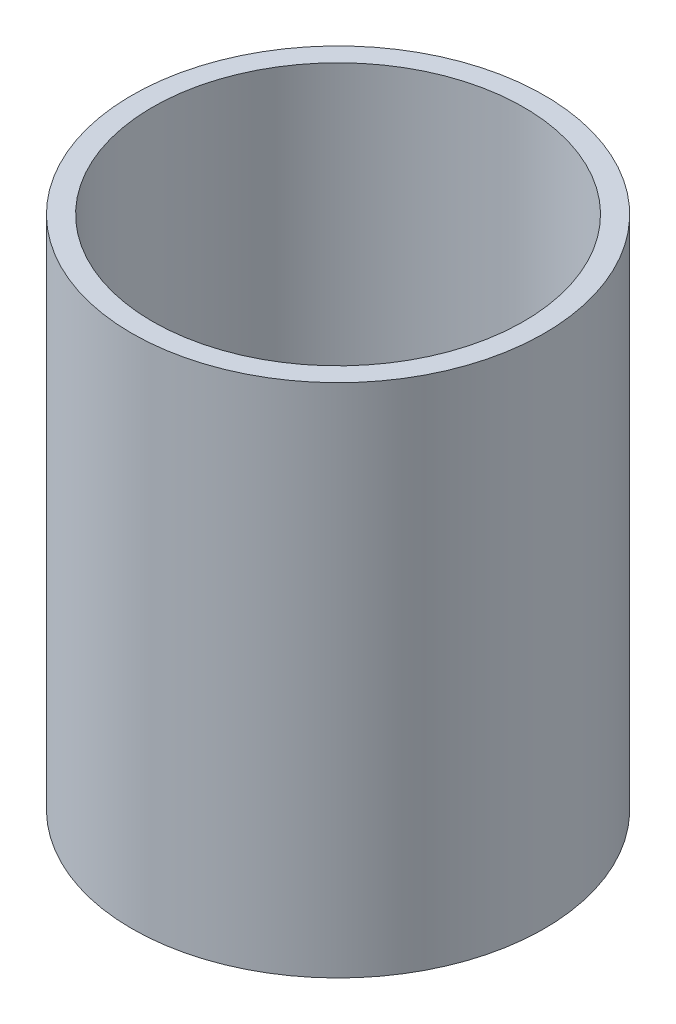
ISO-10303-21;
HEADER;
FILE_DESCRIPTION(('STEP AP214'),'2;1');
FILE_NAME('part.step','',(''),(''),'','','');
FILE_SCHEMA(('AUTOMOTIVE_DESIGN { 1 0 10303 214 1 1 1 1 }'));
ENDSEC;
DATA;
#1=APPLICATION_CONTEXT('core data for automotive mechanical design processes');
#2=APPLICATION_PROTOCOL_DEFINITION('international standard','automotive_design',2000,#1);
#3=PRODUCT_CONTEXT('',#1,'mechanical');
#4=PRODUCT('Part','Part','',(#3));
#5=PRODUCT_RELATED_PRODUCT_CATEGORY('part','',(#4));
#6=PRODUCT_DEFINITION_FORMATION('','',#4);
#7=PRODUCT_DEFINITION_CONTEXT('part definition',#1,'design');
#8=PRODUCT_DEFINITION('design','',#6,#7);
#9=PRODUCT_DEFINITION_SHAPE('','',#8);
#10=(LENGTH_UNIT() NAMED_UNIT(*) SI_UNIT(.MILLI.,.METRE.));
#11=(NAMED_UNIT(*) PLANE_ANGLE_UNIT() SI_UNIT($,.RADIAN.));
#12=(NAMED_UNIT(*) SI_UNIT($,.STERADIAN.) SOLID_ANGLE_UNIT());
#13=UNCERTAINTY_MEASURE_WITH_UNIT(LENGTH_MEASURE(1.E-05),#10,'distance_accuracy_value','');
#14=(GEOMETRIC_REPRESENTATION_CONTEXT(3) GLOBAL_UNCERTAINTY_ASSIGNED_CONTEXT((#13)) GLOBAL_UNIT_ASSIGNED_CONTEXT((#10,
#11,#12)) REPRESENTATION_CONTEXT('',''));
#15=CARTESIAN_POINT('',(0.,0.,0.));
#16=DIRECTION('',(0.,0.,1.));
#17=DIRECTION('',(1.,0.,0.));
#18=AXIS2_PLACEMENT_3D('',#15,#16,#17);
#19=CARTESIAN_POINT('',(0.,0.,0.));
#20=DIRECTION('',(0.,1.,0.));
#21=DIRECTION('',(0.,0.,1.));
#22=AXIS2_PLACEMENT_3D('',#19,#20,#21);
#23=PLANE('',#22);
#24=CARTESIAN_POINT('',(0.,0.,0.));
#25=DIRECTION('',(0.,1.,0.));
#26=DIRECTION('',(0.,0.,1.));
#27=AXIS2_PLACEMENT_3D('',#24,#25,#26);
#28=CIRCLE('',#27,20.);
#29=CARTESIAN_POINT('',(0.,0.,20.));
#30=VERTEX_POINT('',#29);
#31=EDGE_CURVE('E136',#30,#30,#28,.T.);
#32=ORIENTED_EDGE('',*,*,#31,.F.);
#33=EDGE_LOOP('',(#32));
#34=FACE_BOUND('',#33,.T.);
#35=CARTESIAN_POINT('',(0.,0.,0.));
#36=DIRECTION('',(0.,1.,0.));
#37=DIRECTION('',(0.,0.,1.));
#38=AXIS2_PLACEMENT_3D('',#35,#36,#37);
#39=CIRCLE('',#38,17.);
#40=CARTESIAN_POINT('',(1.,0.,16.9705627484771));
#41=VERTEX_POINT('',#40);
#42=CARTESIAN_POINT('',(0.999999999999994,0.,-16.9705627484771));
#43=VERTEX_POINT('',#42);
#44=EDGE_CURVE('E94',#41,#43,#39,.T.);
#45=ORIENTED_EDGE('',*,*,#44,.T.);
#46=DIRECTION('',(0.,0.,1.));
#47=VECTOR('',#46,1.);
#48=CARTESIAN_POINT('',(0.999999999999998,0.,0.));
#49=LINE('',#48,#47);
#50=EDGE_CURVE('E124',#43,#41,#49,.T.);
#51=ORIENTED_EDGE('',*,*,#50,.T.);
#52=EDGE_LOOP('',(#45,#51));
#53=FACE_BOUND('',#52,.T.);
#54=DIRECTION('',(0.,0.,1.));
#55=VECTOR('',#54,1.);
#56=CARTESIAN_POINT('',(-0.999999999999993,0.,0.));
#57=LINE('',#56,#55);
#58=CARTESIAN_POINT('',(-0.999999999999993,0.,-16.9705627484771));
#59=VERTEX_POINT('',#58);
#60=CARTESIAN_POINT('',(-0.999999999999993,0.,16.9705627484771));
#61=VERTEX_POINT('',#60);
#62=EDGE_CURVE('E11',#59,#61,#57,.T.);
#63=ORIENTED_EDGE('',*,*,#62,.F.);
#64=CARTESIAN_POINT('',(0.,0.,0.));
#65=DIRECTION('',(0.,1.,0.));
#66=DIRECTION('',(0.,0.,1.));
#67=AXIS2_PLACEMENT_3D('',#64,#65,#66);
#68=CIRCLE('',#67,17.);
#69=EDGE_CURVE('E56',#59,#61,#68,.T.);
#70=ORIENTED_EDGE('',*,*,#69,.T.);
#71=EDGE_LOOP('',(#63,#70));
#72=FACE_BOUND('',#71,.T.);
#73=ADVANCED_FACE('F47',(#34,#53,#72),#23,.F.);
#74=CARTESIAN_POINT('',(0.,2.,0.));
#75=DIRECTION('',(0.,1.,0.));
#76=DIRECTION('',(0.,0.,1.));
#77=AXIS2_PLACEMENT_3D('',#74,#75,#76);
#78=PLANE('',#77);
#79=DIRECTION('',(0.,0.,1.));
#80=VECTOR('',#79,1.);
#81=CARTESIAN_POINT('',(0.999999999999998,2.,0.));
#82=LINE('',#81,#80);
#83=CARTESIAN_POINT('',(0.999999999999994,2.,-16.9705627484771));
#84=VERTEX_POINT('',#83);
#85=CARTESIAN_POINT('',(1.,2.,16.9705627484771));
#86=VERTEX_POINT('',#85);
#87=EDGE_CURVE('E112',#84,#86,#82,.T.);
#88=ORIENTED_EDGE('',*,*,#87,.F.);
#89=CARTESIAN_POINT('',(0.,2.,0.));
#90=DIRECTION('',(0.,1.,0.));
#91=DIRECTION('',(0.,0.,1.));
#92=AXIS2_PLACEMENT_3D('',#89,#90,#91);
#93=CIRCLE('',#92,17.);
#94=EDGE_CURVE('E115',#86,#84,#93,.T.);
#95=ORIENTED_EDGE('',*,*,#94,.F.);
#96=EDGE_LOOP('',(#88,#95));
#97=FACE_BOUND('',#96,.T.);
#98=CARTESIAN_POINT('',(0.,2.,0.));
#99=DIRECTION('',(0.,1.,0.));
#100=DIRECTION('',(0.,0.,1.));
#101=AXIS2_PLACEMENT_3D('',#98,#99,#100);
#102=CIRCLE('',#101,18.);
#103=CARTESIAN_POINT('',(0.,2.,18.));
#104=VERTEX_POINT('',#103);
#105=EDGE_CURVE('E128',#104,#104,#102,.T.);
#106=ORIENTED_EDGE('',*,*,#105,.T.);
#107=EDGE_LOOP('',(#106));
#108=FACE_BOUND('',#107,.T.);
#109=CARTESIAN_POINT('',(0.,2.,0.));
#110=DIRECTION('',(0.,1.,0.));
#111=DIRECTION('',(0.,0.,1.));
#112=AXIS2_PLACEMENT_3D('',#109,#110,#111);
#113=CIRCLE('',#112,17.);
#114=CARTESIAN_POINT('',(-0.999999999999993,2.,-16.9705627484771));
#115=VERTEX_POINT('',#114);
#116=CARTESIAN_POINT('',(-0.999999999999993,2.,16.9705627484771));
#117=VERTEX_POINT('',#116);
#118=EDGE_CURVE('E98',#115,#117,#113,.T.);
#119=ORIENTED_EDGE('',*,*,#118,.F.);
#120=DIRECTION('',(0.,0.,1.));
#121=VECTOR('',#120,1.);
#122=CARTESIAN_POINT('',(-0.999999999999993,2.,0.));
#123=LINE('',#122,#121);
#124=EDGE_CURVE('E89',#115,#117,#123,.T.);
#125=ORIENTED_EDGE('',*,*,#124,.T.);
#126=EDGE_LOOP('',(#119,#125));
#127=FACE_BOUND('',#126,.T.);
#128=ADVANCED_FACE('F103',(#97,#108,#127),#78,.T.);
#129=CARTESIAN_POINT('',(0.,50.,0.));
#130=DIRECTION('',(0.,-1.,0.));
#131=DIRECTION('',(0.,0.,-1.));
#132=AXIS2_PLACEMENT_3D('',#129,#130,#131);
#133=CYLINDRICAL_SURFACE('',#132,20.);
#134=CARTESIAN_POINT('',(0.,50.,0.));
#135=DIRECTION('',(0.,1.,0.));
#136=DIRECTION('',(0.,0.,1.));
#137=AXIS2_PLACEMENT_3D('',#134,#135,#136);
#138=CIRCLE('',#137,20.);
#139=CARTESIAN_POINT('',(0.,50.,20.));
#140=VERTEX_POINT('',#139);
#141=EDGE_CURVE('E137',#140,#140,#138,.T.);
#142=ORIENTED_EDGE('',*,*,#141,.F.);
#143=EDGE_LOOP('',(#142));
#144=FACE_BOUND('',#143,.T.);
#145=ORIENTED_EDGE('',*,*,#31,.T.);
#146=EDGE_LOOP('',(#145));
#147=FACE_BOUND('',#146,.T.);
#148=ADVANCED_FACE('F49',(#144,#147),#133,.T.);
#149=CARTESIAN_POINT('',(0.,50.,0.));
#150=DIRECTION('',(0.,1.,0.));
#151=DIRECTION('',(0.,0.,1.));
#152=AXIS2_PLACEMENT_3D('',#149,#150,#151);
#153=PLANE('',#152);
#154=CARTESIAN_POINT('',(0.,50.,0.));
#155=DIRECTION('',(0.,1.,0.));
#156=DIRECTION('',(0.,0.,1.));
#157=AXIS2_PLACEMENT_3D('',#154,#155,#156);
#158=CIRCLE('',#157,18.);
#159=CARTESIAN_POINT('',(0.,50.,18.));
#160=VERTEX_POINT('',#159);
#161=EDGE_CURVE('E132',#160,#160,#158,.T.);
#162=ORIENTED_EDGE('',*,*,#161,.F.);
#163=EDGE_LOOP('',(#162));
#164=FACE_BOUND('',#163,.T.);
#165=ORIENTED_EDGE('',*,*,#141,.T.);
#166=EDGE_LOOP('',(#165));
#167=FACE_BOUND('',#166,.T.);
#168=ADVANCED_FACE('F156',(#164,#167),#153,.T.);
#169=CARTESIAN_POINT('',(0.,50.,0.));
#170=DIRECTION('',(0.,-1.,0.));
#171=DIRECTION('',(0.,0.,-1.));
#172=AXIS2_PLACEMENT_3D('',#169,#170,#171);
#173=CYLINDRICAL_SURFACE('',#172,18.);
#174=ORIENTED_EDGE('',*,*,#161,.T.);
#175=EDGE_LOOP('',(#174));
#176=FACE_BOUND('',#175,.T.);
#177=ORIENTED_EDGE('',*,*,#105,.F.);
#178=EDGE_LOOP('',(#177));
#179=FACE_BOUND('',#178,.T.);
#180=ADVANCED_FACE('F158',(#176,#179),#173,.F.);
#181=CARTESIAN_POINT('',(0.999999999999998,-48.,0.));
#182=DIRECTION('',(-1.,0.,0.));
#183=DIRECTION('',(0.,0.,1.));
#184=AXIS2_PLACEMENT_3D('',#181,#182,#183);
#185=PLANE('',#184);
#186=DIRECTION('',(0.,1.,0.));
#187=VECTOR('',#186,1.);
#188=CARTESIAN_POINT('',(0.999999999999994,-48.,-16.9705627484771));
#189=LINE('',#188,#187);
#190=EDGE_CURVE('E70',#43,#84,#189,.T.);
#191=ORIENTED_EDGE('',*,*,#190,.T.);
#192=ORIENTED_EDGE('',*,*,#87,.T.);
#193=DIRECTION('',(0.,1.,0.));
#194=VECTOR('',#193,1.);
#195=CARTESIAN_POINT('',(1.,-48.,16.9705627484771));
#196=LINE('',#195,#194);
#197=EDGE_CURVE('E107',#41,#86,#196,.T.);
#198=ORIENTED_EDGE('',*,*,#197,.F.);
#199=ORIENTED_EDGE('',*,*,#50,.F.);
#200=EDGE_LOOP('',(#191,#192,#198,#199));
#201=FACE_BOUND('',#200,.T.);
#202=ADVANCED_FACE('F162',(#201),#185,.F.);
#203=CARTESIAN_POINT('',(0.,-48.,0.));
#204=DIRECTION('',(0.,1.,0.));
#205=DIRECTION('',(0.,0.,1.));
#206=AXIS2_PLACEMENT_3D('',#203,#204,#205);
#207=CYLINDRICAL_SURFACE('',#206,17.);
#208=ORIENTED_EDGE('',*,*,#197,.T.);
#209=ORIENTED_EDGE('',*,*,#94,.T.);
#210=ORIENTED_EDGE('',*,*,#190,.F.);
#211=ORIENTED_EDGE('',*,*,#44,.F.);
#212=EDGE_LOOP('',(#208,#209,#210,#211));
#213=FACE_BOUND('',#212,.T.);
#214=ADVANCED_FACE('F166',(#213),#207,.F.);
#215=CARTESIAN_POINT('',(-0.999999999999993,-48.,0.));
#216=DIRECTION('',(-1.,0.,0.));
#217=DIRECTION('',(0.,0.,1.));
#218=AXIS2_PLACEMENT_3D('',#215,#216,#217);
#219=PLANE('',#218);
#220=ORIENTED_EDGE('',*,*,#62,.T.);
#221=DIRECTION('',(0.,1.,0.));
#222=VECTOR('',#221,1.);
#223=CARTESIAN_POINT('',(-0.999999999999993,-48.,16.9705627484771));
#224=LINE('',#223,#222);
#225=EDGE_CURVE('E63',#61,#117,#224,.T.);
#226=ORIENTED_EDGE('',*,*,#225,.T.);
#227=ORIENTED_EDGE('',*,*,#124,.F.);
#228=DIRECTION('',(0.,1.,0.));
#229=VECTOR('',#228,1.);
#230=CARTESIAN_POINT('',(-0.999999999999993,-48.,-16.9705627484771));
#231=LINE('',#230,#229);
#232=EDGE_CURVE('E95',#59,#115,#231,.T.);
#233=ORIENTED_EDGE('',*,*,#232,.F.);
#234=EDGE_LOOP('',(#220,#226,#227,#233));
#235=FACE_BOUND('',#234,.T.);
#236=ADVANCED_FACE('F86',(#235),#219,.T.);
#237=CARTESIAN_POINT('',(0.,-48.,0.));
#238=DIRECTION('',(0.,1.,0.));
#239=DIRECTION('',(0.,0.,1.));
#240=AXIS2_PLACEMENT_3D('',#237,#238,#239);
#241=CYLINDRICAL_SURFACE('',#240,17.);
#242=ORIENTED_EDGE('',*,*,#232,.T.);
#243=ORIENTED_EDGE('',*,*,#118,.T.);
#244=ORIENTED_EDGE('',*,*,#225,.F.);
#245=ORIENTED_EDGE('',*,*,#69,.F.);
#246=EDGE_LOOP('',(#242,#243,#244,#245));
#247=FACE_BOUND('',#246,.T.);
#248=ADVANCED_FACE('F99',(#247),#241,.F.);
#249=CLOSED_SHELL('',(#73,#128,#148,#168,#180,#202,#214,#236,#248));
#250=MANIFOLD_SOLID_BREP('B2',#249);
#251=ADVANCED_BREP_SHAPE_REPRESENTATION('',(#18,#250),#14);
#252=SHAPE_DEFINITION_REPRESENTATION(#9,#251);
ENDSEC;
END-ISO-10303-21;
